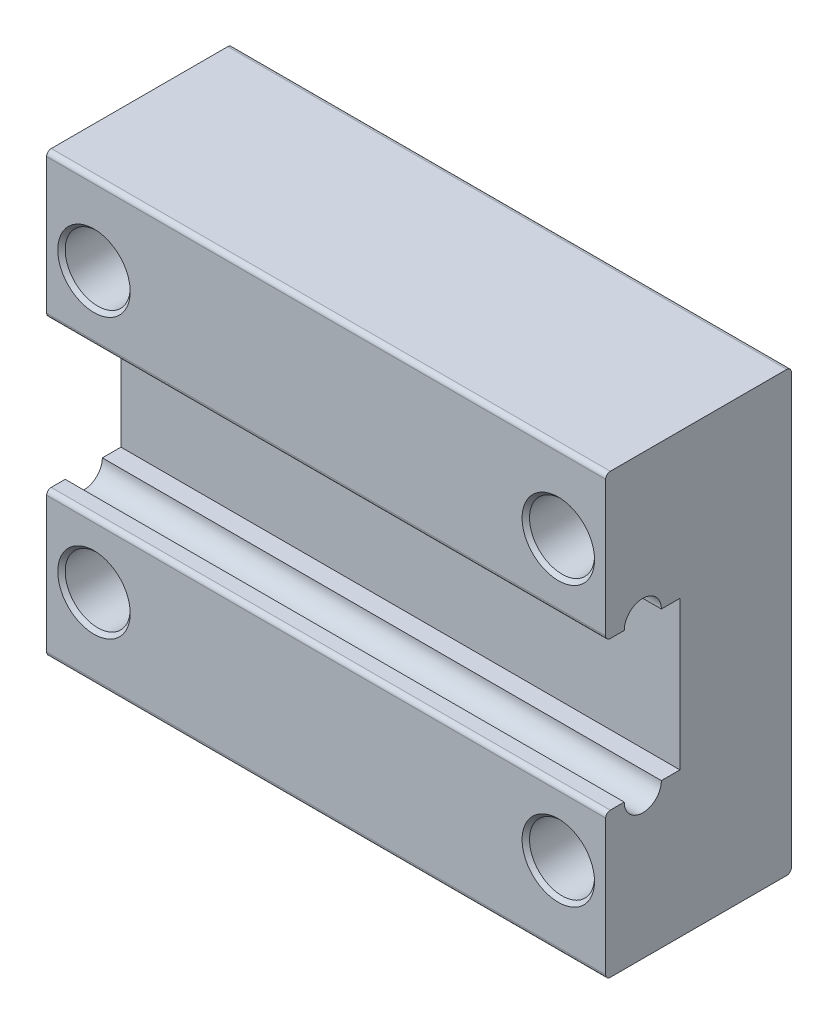
ISO-10303-21;
HEADER;
FILE_DESCRIPTION(('STEP AP214'),'2;1');
FILE_NAME('part.step','',(''),(''),'','','');
FILE_SCHEMA(('AUTOMOTIVE_DESIGN { 1 0 10303 214 1 1 1 1 }'));
ENDSEC;
DATA;
#1=APPLICATION_CONTEXT('core data for automotive mechanical design processes');
#2=APPLICATION_PROTOCOL_DEFINITION('international standard','automotive_design',2000,#1);
#3=PRODUCT_CONTEXT('',#1,'mechanical');
#4=PRODUCT('Part','Part','',(#3));
#5=PRODUCT_RELATED_PRODUCT_CATEGORY('part','',(#4));
#6=PRODUCT_DEFINITION_FORMATION('','',#4);
#7=PRODUCT_DEFINITION_CONTEXT('part definition',#1,'design');
#8=PRODUCT_DEFINITION('design','',#6,#7);
#9=PRODUCT_DEFINITION_SHAPE('','',#8);
#10=(LENGTH_UNIT() NAMED_UNIT(*) SI_UNIT(.MILLI.,.METRE.));
#11=(NAMED_UNIT(*) PLANE_ANGLE_UNIT() SI_UNIT($,.RADIAN.));
#12=(NAMED_UNIT(*) SI_UNIT($,.STERADIAN.) SOLID_ANGLE_UNIT());
#13=UNCERTAINTY_MEASURE_WITH_UNIT(LENGTH_MEASURE(1.E-05),#10,'distance_accuracy_value','');
#14=(GEOMETRIC_REPRESENTATION_CONTEXT(3) GLOBAL_UNCERTAINTY_ASSIGNED_CONTEXT((#13)) GLOBAL_UNIT_ASSIGNED_CONTEXT((#10,
#11,#12)) REPRESENTATION_CONTEXT('',''));
#15=CARTESIAN_POINT('',(0.,0.,0.));
#16=DIRECTION('',(0.,0.,1.));
#17=DIRECTION('',(1.,0.,0.));
#18=AXIS2_PLACEMENT_3D('',#15,#16,#17);
#19=CARTESIAN_POINT('',(0.,0.,10.));
#20=DIRECTION('',(0.,0.,1.));
#21=DIRECTION('',(1.,0.,0.));
#22=AXIS2_PLACEMENT_3D('',#19,#20,#21);
#23=PLANE('',#22);
#24=DIRECTION('',(0.,-1.,0.));
#25=VECTOR('',#24,1.);
#26=CARTESIAN_POINT('',(-15.05,17.4912238040008,10.));
#27=LINE('',#26,#25);
#28=CARTESIAN_POINT('',(-15.05,-4.25,10.));
#29=VERTEX_POINT('',#28);
#30=CARTESIAN_POINT('',(-15.05,-11.55,10.));
#31=VERTEX_POINT('',#30);
#32=EDGE_CURVE('E253',#29,#31,#27,.T.);
#33=ORIENTED_EDGE('',*,*,#32,.T.);
#34=DIRECTION('',(1.,0.,0.));
#35=VECTOR('',#34,1.);
#36=CARTESIAN_POINT('',(22.5,-11.55,10.));
#37=LINE('',#36,#35);
#38=CARTESIAN_POINT('',(15.05,-11.55,10.));
#39=VERTEX_POINT('',#38);
#40=EDGE_CURVE('E259',#31,#39,#37,.T.);
#41=ORIENTED_EDGE('',*,*,#40,.T.);
#42=DIRECTION('',(0.,1.,0.));
#43=VECTOR('',#42,1.);
#44=CARTESIAN_POINT('',(15.05,17.4912238040008,10.));
#45=LINE('',#44,#43);
#46=CARTESIAN_POINT('',(15.05,-4.25,10.));
#47=VERTEX_POINT('',#46);
#48=EDGE_CURVE('E254',#39,#47,#45,.T.);
#49=ORIENTED_EDGE('',*,*,#48,.T.);
#50=DIRECTION('',(1.,0.,0.));
#51=VECTOR('',#50,1.);
#52=CARTESIAN_POINT('',(0.,-4.25,10.));
#53=LINE('',#52,#51);
#54=EDGE_CURVE('E264',#47,#29,#53,.F.);
#55=ORIENTED_EDGE('',*,*,#54,.T.);
#56=EDGE_LOOP('',(#33,#41,#49,#55));
#57=FACE_BOUND('',#56,.T.);
#58=CARTESIAN_POINT('',(12.5,-7.5,10.));
#59=DIRECTION('',(0.,0.,1.));
#60=DIRECTION('',(1.,0.,0.));
#61=AXIS2_PLACEMENT_3D('',#58,#59,#60);
#62=CIRCLE('',#61,1.94999999999999);
#63=CARTESIAN_POINT('',(14.45,-7.5,10.));
#64=VERTEX_POINT('',#63);
#65=EDGE_CURVE('E305',#64,#64,#62,.F.);
#66=ORIENTED_EDGE('',*,*,#65,.T.);
#67=EDGE_LOOP('',(#66));
#68=FACE_BOUND('',#67,.T.);
#69=CARTESIAN_POINT('',(-12.4999999999999,-7.5,10.));
#70=DIRECTION('',(0.,0.,1.));
#71=DIRECTION('',(1.,0.,0.));
#72=AXIS2_PLACEMENT_3D('',#69,#70,#71);
#73=CIRCLE('',#72,1.94999999999999);
#74=CARTESIAN_POINT('',(-10.55,-7.5,10.));
#75=VERTEX_POINT('',#74);
#76=EDGE_CURVE('E302',#75,#75,#73,.F.);
#77=ORIENTED_EDGE('',*,*,#76,.T.);
#78=EDGE_LOOP('',(#77));
#79=FACE_BOUND('',#78,.T.);
#80=ADVANCED_FACE('F113',(#57,#68,#79),#23,.T.);
#81=CARTESIAN_POINT('',(-15.05,11.55,10.));
#82=VERTEX_POINT('',#81);
#83=CARTESIAN_POINT('',(-15.05,4.25,10.));
#84=VERTEX_POINT('',#83);
#85=EDGE_CURVE('E457',#82,#84,#27,.T.);
#86=ORIENTED_EDGE('',*,*,#85,.T.);
#87=DIRECTION('',(1.,0.,0.));
#88=VECTOR('',#87,1.);
#89=CARTESIAN_POINT('',(22.5,4.25,10.));
#90=LINE('',#89,#88);
#91=CARTESIAN_POINT('',(15.05,4.25,10.));
#92=VERTEX_POINT('',#91);
#93=EDGE_CURVE('E272',#84,#92,#90,.T.);
#94=ORIENTED_EDGE('',*,*,#93,.T.);
#95=CARTESIAN_POINT('',(15.05,11.55,10.));
#96=VERTEX_POINT('',#95);
#97=EDGE_CURVE('E336',#92,#96,#45,.T.);
#98=ORIENTED_EDGE('',*,*,#97,.T.);
#99=DIRECTION('',(-1.,0.,0.));
#100=VECTOR('',#99,1.);
#101=CARTESIAN_POINT('',(-22.5,11.55,10.));
#102=LINE('',#101,#100);
#103=EDGE_CURVE('E275',#96,#82,#102,.T.);
#104=ORIENTED_EDGE('',*,*,#103,.T.);
#105=EDGE_LOOP('',(#86,#94,#98,#104));
#106=FACE_BOUND('',#105,.T.);
#107=CARTESIAN_POINT('',(12.5,7.5,10.));
#108=DIRECTION('',(0.,0.,1.));
#109=DIRECTION('',(1.,0.,0.));
#110=AXIS2_PLACEMENT_3D('',#107,#108,#109);
#111=CIRCLE('',#110,1.95);
#112=CARTESIAN_POINT('',(14.45,7.5,10.));
#113=VERTEX_POINT('',#112);
#114=EDGE_CURVE('E323',#113,#113,#111,.F.);
#115=ORIENTED_EDGE('',*,*,#114,.T.);
#116=EDGE_LOOP('',(#115));
#117=FACE_BOUND('',#116,.T.);
#118=CARTESIAN_POINT('',(-12.5,7.5,10.));
#119=DIRECTION('',(0.,0.,1.));
#120=DIRECTION('',(1.,0.,0.));
#121=AXIS2_PLACEMENT_3D('',#118,#119,#120);
#122=CIRCLE('',#121,1.95);
#123=CARTESIAN_POINT('',(-10.55,7.5,10.));
#124=VERTEX_POINT('',#123);
#125=EDGE_CURVE('E320',#124,#124,#122,.F.);
#126=ORIENTED_EDGE('',*,*,#125,.T.);
#127=EDGE_LOOP('',(#126));
#128=FACE_BOUND('',#127,.T.);
#129=ADVANCED_FACE('F460',(#106,#117,#128),#23,.T.);
#130=CARTESIAN_POINT('',(0.,0.,0.));
#131=DIRECTION('',(0.,0.,1.));
#132=DIRECTION('',(1.,0.,0.));
#133=AXIS2_PLACEMENT_3D('',#130,#131,#132);
#134=PLANE('',#133);
#135=CARTESIAN_POINT('',(12.5,-7.5,0.));
#136=DIRECTION('',(0.,0.,1.));
#137=DIRECTION('',(1.,0.,0.));
#138=AXIS2_PLACEMENT_3D('',#135,#136,#137);
#139=CIRCLE('',#138,1.95000000000001);
#140=CARTESIAN_POINT('',(14.45,-7.5,0.));
#141=VERTEX_POINT('',#140);
#142=EDGE_CURVE('E293',#141,#141,#139,.T.);
#143=ORIENTED_EDGE('',*,*,#142,.T.);
#144=EDGE_LOOP('',(#143));
#145=FACE_BOUND('',#144,.T.);
#146=CARTESIAN_POINT('',(-12.4999999999999,-7.5,0.));
#147=DIRECTION('',(0.,0.,1.));
#148=DIRECTION('',(1.,0.,0.));
#149=AXIS2_PLACEMENT_3D('',#146,#147,#148);
#150=CIRCLE('',#149,1.95000000000001);
#151=CARTESIAN_POINT('',(-10.5499999999999,-7.5,0.));
#152=VERTEX_POINT('',#151);
#153=EDGE_CURVE('E290',#152,#152,#150,.T.);
#154=ORIENTED_EDGE('',*,*,#153,.T.);
#155=EDGE_LOOP('',(#154));
#156=FACE_BOUND('',#155,.T.);
#157=CARTESIAN_POINT('',(12.5,7.5,0.));
#158=DIRECTION('',(0.,0.,1.));
#159=DIRECTION('',(1.,0.,0.));
#160=AXIS2_PLACEMENT_3D('',#157,#158,#159);
#161=CIRCLE('',#160,1.95);
#162=CARTESIAN_POINT('',(14.45,7.5,0.));
#163=VERTEX_POINT('',#162);
#164=EDGE_CURVE('E287',#163,#163,#161,.T.);
#165=ORIENTED_EDGE('',*,*,#164,.T.);
#166=EDGE_LOOP('',(#165));
#167=FACE_BOUND('',#166,.T.);
#168=CARTESIAN_POINT('',(-12.5,7.5,0.));
#169=DIRECTION('',(0.,0.,1.));
#170=DIRECTION('',(1.,0.,0.));
#171=AXIS2_PLACEMENT_3D('',#168,#169,#170);
#172=CIRCLE('',#171,1.95);
#173=CARTESIAN_POINT('',(-10.55,7.5,0.));
#174=VERTEX_POINT('',#173);
#175=EDGE_CURVE('E284',#174,#174,#172,.T.);
#176=ORIENTED_EDGE('',*,*,#175,.T.);
#177=EDGE_LOOP('',(#176));
#178=FACE_BOUND('',#177,.T.);
#179=DIRECTION('',(1.,0.,0.));
#180=VECTOR('',#179,1.);
#181=CARTESIAN_POINT('',(0.,-11.55,0.));
#182=LINE('',#181,#180);
#183=CARTESIAN_POINT('',(15.05,-11.55,0.));
#184=VERTEX_POINT('',#183);
#185=CARTESIAN_POINT('',(-15.05,-11.55,0.));
#186=VERTEX_POINT('',#185);
#187=EDGE_CURVE('E252',#184,#186,#182,.F.);
#188=ORIENTED_EDGE('',*,*,#187,.T.);
#189=DIRECTION('',(0.,-1.,0.));
#190=VECTOR('',#189,1.);
#191=CARTESIAN_POINT('',(-15.05,17.4912238040008,0.));
#192=LINE('',#191,#190);
#193=CARTESIAN_POINT('',(-15.05,11.55,0.));
#194=VERTEX_POINT('',#193);
#195=EDGE_CURVE('E127',#194,#186,#192,.T.);
#196=ORIENTED_EDGE('',*,*,#195,.F.);
#197=DIRECTION('',(-1.,0.,0.));
#198=VECTOR('',#197,1.);
#199=CARTESIAN_POINT('',(0.,11.55,0.));
#200=LINE('',#199,#198);
#201=CARTESIAN_POINT('',(15.05,11.55,0.));
#202=VERTEX_POINT('',#201);
#203=EDGE_CURVE('E250',#194,#202,#200,.F.);
#204=ORIENTED_EDGE('',*,*,#203,.T.);
#205=DIRECTION('',(0.,1.,0.));
#206=VECTOR('',#205,1.);
#207=CARTESIAN_POINT('',(15.05,17.4912238040008,0.));
#208=LINE('',#207,#206);
#209=EDGE_CURVE('E332',#184,#202,#208,.T.);
#210=ORIENTED_EDGE('',*,*,#209,.F.);
#211=EDGE_LOOP('',(#188,#196,#204,#210));
#212=FACE_BOUND('',#211,.T.);
#213=ADVANCED_FACE('F248',(#145,#156,#167,#178,#212),#134,.F.);
#214=CARTESIAN_POINT('',(22.5,-11.8,10.));
#215=DIRECTION('',(0.,1.,0.));
#216=DIRECTION('',(-1.,0.,0.));
#217=AXIS2_PLACEMENT_3D('',#214,#215,#216);
#218=PLANE('',#217);
#219=DIRECTION('',(1.,0.,0.));
#220=VECTOR('',#219,1.);
#221=CARTESIAN_POINT('',(-22.5,-11.8,9.75));
#222=LINE('',#221,#220);
#223=CARTESIAN_POINT('',(15.05,-11.8,9.75));
#224=VERTEX_POINT('',#223);
#225=CARTESIAN_POINT('',(-15.05,-11.8,9.75));
#226=VERTEX_POINT('',#225);
#227=EDGE_CURVE('E347',#224,#226,#222,.F.);
#228=ORIENTED_EDGE('',*,*,#227,.T.);
#229=DIRECTION('',(0.,0.,-1.));
#230=VECTOR('',#229,1.);
#231=CARTESIAN_POINT('',(-15.05,-11.8,10.));
#232=LINE('',#231,#230);
#233=CARTESIAN_POINT('',(-15.05,-11.8,0.25));
#234=VERTEX_POINT('',#233);
#235=EDGE_CURVE('E341',#226,#234,#232,.T.);
#236=ORIENTED_EDGE('',*,*,#235,.T.);
#237=DIRECTION('',(1.,0.,0.));
#238=VECTOR('',#237,1.);
#239=CARTESIAN_POINT('',(22.5,-11.8,0.25));
#240=LINE('',#239,#238);
#241=CARTESIAN_POINT('',(15.05,-11.8,0.25));
#242=VERTEX_POINT('',#241);
#243=EDGE_CURVE('E339',#234,#242,#240,.T.);
#244=ORIENTED_EDGE('',*,*,#243,.T.);
#245=DIRECTION('',(0.,0.,1.));
#246=VECTOR('',#245,1.);
#247=CARTESIAN_POINT('',(15.05,-11.8,10.));
#248=LINE('',#247,#246);
#249=EDGE_CURVE('E135',#242,#224,#248,.T.);
#250=ORIENTED_EDGE('',*,*,#249,.T.);
#251=EDGE_LOOP('',(#228,#236,#244,#250));
#252=FACE_BOUND('',#251,.T.);
#253=ADVANCED_FACE('F345',(#252),#218,.F.);
#254=CARTESIAN_POINT('',(22.5,11.8,10.));
#255=DIRECTION('',(0.,-1.,0.));
#256=DIRECTION('',(1.,0.,0.));
#257=AXIS2_PLACEMENT_3D('',#254,#255,#256);
#258=PLANE('',#257);
#259=DIRECTION('',(-1.,0.,0.));
#260=VECTOR('',#259,1.);
#261=CARTESIAN_POINT('',(22.5,11.8,0.25));
#262=LINE('',#261,#260);
#263=CARTESIAN_POINT('',(15.05,11.8,0.25));
#264=VERTEX_POINT('',#263);
#265=CARTESIAN_POINT('',(-15.05,11.8,0.25));
#266=VERTEX_POINT('',#265);
#267=EDGE_CURVE('E261',#264,#266,#262,.T.);
#268=ORIENTED_EDGE('',*,*,#267,.T.);
#269=DIRECTION('',(0.,0.,1.));
#270=VECTOR('',#269,1.);
#271=CARTESIAN_POINT('',(-15.05,11.8,10.));
#272=LINE('',#271,#270);
#273=CARTESIAN_POINT('',(-15.05,11.8,9.75));
#274=VERTEX_POINT('',#273);
#275=EDGE_CURVE('E238',#266,#274,#272,.T.);
#276=ORIENTED_EDGE('',*,*,#275,.T.);
#277=DIRECTION('',(-1.,0.,0.));
#278=VECTOR('',#277,1.);
#279=CARTESIAN_POINT('',(22.5,11.8,9.75));
#280=LINE('',#279,#278);
#281=CARTESIAN_POINT('',(15.05,11.8,9.75));
#282=VERTEX_POINT('',#281);
#283=EDGE_CURVE('E269',#274,#282,#280,.F.);
#284=ORIENTED_EDGE('',*,*,#283,.T.);
#285=DIRECTION('',(0.,0.,-1.));
#286=VECTOR('',#285,1.);
#287=CARTESIAN_POINT('',(15.05,11.8,10.));
#288=LINE('',#287,#286);
#289=EDGE_CURVE('E353',#282,#264,#288,.T.);
#290=ORIENTED_EDGE('',*,*,#289,.T.);
#291=EDGE_LOOP('',(#268,#276,#284,#290));
#292=FACE_BOUND('',#291,.T.);
#293=ADVANCED_FACE('F481',(#292),#258,.F.);
#294=CARTESIAN_POINT('',(-12.5,7.5,10.));
#295=DIRECTION('',(0.,0.,-1.));
#296=DIRECTION('',(-1.,0.,0.));
#297=AXIS2_PLACEMENT_3D('',#294,#295,#296);
#298=CYLINDRICAL_SURFACE('',#297,1.75);
#299=CARTESIAN_POINT('',(-12.5,7.5,0.200000000000006));
#300=DIRECTION('',(0.,0.,1.));
#301=DIRECTION('',(1.,0.,0.));
#302=AXIS2_PLACEMENT_3D('',#299,#300,#301);
#303=CIRCLE('',#302,1.75);
#304=CARTESIAN_POINT('',(-10.75,7.5,0.200000000000006));
#305=VERTEX_POINT('',#304);
#306=EDGE_CURVE('E329',#305,#305,#303,.F.);
#307=ORIENTED_EDGE('',*,*,#306,.T.);
#308=EDGE_LOOP('',(#307));
#309=FACE_BOUND('',#308,.T.);
#310=CARTESIAN_POINT('',(-12.5,7.5,9.8));
#311=DIRECTION('',(0.,0.,1.));
#312=DIRECTION('',(1.,0.,0.));
#313=AXIS2_PLACEMENT_3D('',#310,#311,#312);
#314=CIRCLE('',#313,1.75);
#315=CARTESIAN_POINT('',(-10.75,7.5,9.8));
#316=VERTEX_POINT('',#315);
#317=EDGE_CURVE('E326',#316,#316,#314,.T.);
#318=ORIENTED_EDGE('',*,*,#317,.T.);
#319=EDGE_LOOP('',(#318));
#320=FACE_BOUND('',#319,.T.);
#321=ADVANCED_FACE('F501',(#309,#320),#298,.F.);
#322=CARTESIAN_POINT('',(12.5,7.5,10.));
#323=DIRECTION('',(0.,0.,-1.));
#324=DIRECTION('',(-1.,0.,0.));
#325=AXIS2_PLACEMENT_3D('',#322,#323,#324);
#326=CYLINDRICAL_SURFACE('',#325,1.75);
#327=CARTESIAN_POINT('',(12.5,7.5,0.200000000000006));
#328=DIRECTION('',(0.,0.,1.));
#329=DIRECTION('',(1.,0.,0.));
#330=AXIS2_PLACEMENT_3D('',#327,#328,#329);
#331=CIRCLE('',#330,1.75);
#332=CARTESIAN_POINT('',(14.25,7.5,0.200000000000006));
#333=VERTEX_POINT('',#332);
#334=EDGE_CURVE('E317',#333,#333,#331,.F.);
#335=ORIENTED_EDGE('',*,*,#334,.T.);
#336=EDGE_LOOP('',(#335));
#337=FACE_BOUND('',#336,.T.);
#338=CARTESIAN_POINT('',(12.5,7.5,9.8));
#339=DIRECTION('',(0.,0.,1.));
#340=DIRECTION('',(1.,0.,0.));
#341=AXIS2_PLACEMENT_3D('',#338,#339,#340);
#342=CIRCLE('',#341,1.75);
#343=CARTESIAN_POINT('',(14.25,7.5,9.8));
#344=VERTEX_POINT('',#343);
#345=EDGE_CURVE('E314',#344,#344,#342,.T.);
#346=ORIENTED_EDGE('',*,*,#345,.T.);
#347=EDGE_LOOP('',(#346));
#348=FACE_BOUND('',#347,.T.);
#349=ADVANCED_FACE('F568',(#337,#348),#326,.F.);
#350=CARTESIAN_POINT('',(12.5,-7.5,10.));
#351=DIRECTION('',(0.,0.,-1.));
#352=DIRECTION('',(-1.,0.,0.));
#353=AXIS2_PLACEMENT_3D('',#350,#351,#352);
#354=CYLINDRICAL_SURFACE('',#353,1.75);
#355=CARTESIAN_POINT('',(12.5,-7.5,0.200000000000006));
#356=DIRECTION('',(0.,0.,1.));
#357=DIRECTION('',(1.,0.,0.));
#358=AXIS2_PLACEMENT_3D('',#355,#356,#357);
#359=CIRCLE('',#358,1.75);
#360=CARTESIAN_POINT('',(14.25,-7.5,0.200000000000006));
#361=VERTEX_POINT('',#360);
#362=EDGE_CURVE('E299',#361,#361,#359,.F.);
#363=ORIENTED_EDGE('',*,*,#362,.T.);
#364=EDGE_LOOP('',(#363));
#365=FACE_BOUND('',#364,.T.);
#366=CARTESIAN_POINT('',(12.5,-7.5,9.8));
#367=DIRECTION('',(0.,0.,1.));
#368=DIRECTION('',(1.,0.,0.));
#369=AXIS2_PLACEMENT_3D('',#366,#367,#368);
#370=CIRCLE('',#369,1.75);
#371=CARTESIAN_POINT('',(14.25,-7.5,9.8));
#372=VERTEX_POINT('',#371);
#373=EDGE_CURVE('E296',#372,#372,#370,.T.);
#374=ORIENTED_EDGE('',*,*,#373,.T.);
#375=EDGE_LOOP('',(#374));
#376=FACE_BOUND('',#375,.T.);
#377=ADVANCED_FACE('F565',(#365,#376),#354,.F.);
#378=CARTESIAN_POINT('',(-12.4999999999999,-7.5,10.));
#379=DIRECTION('',(0.,0.,-1.));
#380=DIRECTION('',(-1.,0.,0.));
#381=AXIS2_PLACEMENT_3D('',#378,#379,#380);
#382=CYLINDRICAL_SURFACE('',#381,1.75);
#383=CARTESIAN_POINT('',(-12.4999999999999,-7.5,0.200000000000006));
#384=DIRECTION('',(0.,0.,1.));
#385=DIRECTION('',(1.,0.,0.));
#386=AXIS2_PLACEMENT_3D('',#383,#384,#385);
#387=CIRCLE('',#386,1.75);
#388=CARTESIAN_POINT('',(-10.7499999999999,-7.5,0.200000000000006));
#389=VERTEX_POINT('',#388);
#390=EDGE_CURVE('E311',#389,#389,#387,.F.);
#391=ORIENTED_EDGE('',*,*,#390,.T.);
#392=EDGE_LOOP('',(#391));
#393=FACE_BOUND('',#392,.T.);
#394=CARTESIAN_POINT('',(-12.4999999999999,-7.5,9.8));
#395=DIRECTION('',(0.,0.,1.));
#396=DIRECTION('',(1.,0.,0.));
#397=AXIS2_PLACEMENT_3D('',#394,#395,#396);
#398=CIRCLE('',#397,1.75);
#399=CARTESIAN_POINT('',(-10.7499999999999,-7.5,9.8));
#400=VERTEX_POINT('',#399);
#401=EDGE_CURVE('E308',#400,#400,#398,.T.);
#402=ORIENTED_EDGE('',*,*,#401,.T.);
#403=EDGE_LOOP('',(#402));
#404=FACE_BOUND('',#403,.T.);
#405=ADVANCED_FACE('F554',(#393,#404),#382,.F.);
#406=CARTESIAN_POINT('',(-22.5,4.,0.));
#407=DIRECTION('',(0.,1.,0.));
#408=DIRECTION('',(0.,0.,1.));
#409=AXIS2_PLACEMENT_3D('',#406,#407,#408);
#410=PLANE('',#409);
#411=DIRECTION('',(1.,0.,0.));
#412=VECTOR('',#411,1.);
#413=CARTESIAN_POINT('',(-22.5,4.,9.75));
#414=LINE('',#413,#412);
#415=CARTESIAN_POINT('',(15.05,4.,9.75));
#416=VERTEX_POINT('',#415);
#417=CARTESIAN_POINT('',(-15.05,4.,9.75));
#418=VERTEX_POINT('',#417);
#419=EDGE_CURVE('E278',#416,#418,#414,.F.);
#420=ORIENTED_EDGE('',*,*,#419,.T.);
#421=DIRECTION('',(0.,0.,-1.));
#422=VECTOR('',#421,1.);
#423=CARTESIAN_POINT('',(-15.05,4.,0.));
#424=LINE('',#423,#422);
#425=CARTESIAN_POINT('',(-15.05,4.,9.));
#426=VERTEX_POINT('',#425);
#427=EDGE_CURVE('E373',#418,#426,#424,.T.);
#428=ORIENTED_EDGE('',*,*,#427,.T.);
#429=DIRECTION('',(1.,0.,0.));
#430=VECTOR('',#429,1.);
#431=CARTESIAN_POINT('',(-22.5,4.,9.));
#432=LINE('',#431,#430);
#433=CARTESIAN_POINT('',(15.05,4.,9.));
#434=VERTEX_POINT('',#433);
#435=EDGE_CURVE('E381',#426,#434,#432,.T.);
#436=ORIENTED_EDGE('',*,*,#435,.T.);
#437=DIRECTION('',(0.,0.,1.));
#438=VECTOR('',#437,1.);
#439=CARTESIAN_POINT('',(15.05,4.,0.));
#440=LINE('',#439,#438);
#441=EDGE_CURVE('E450',#434,#416,#440,.T.);
#442=ORIENTED_EDGE('',*,*,#441,.T.);
#443=EDGE_LOOP('',(#420,#428,#436,#442));
#444=FACE_BOUND('',#443,.T.);
#445=ADVANCED_FACE('F447',(#444),#410,.F.);
#446=DIRECTION('',(1.,0.,0.));
#447=VECTOR('',#446,1.);
#448=CARTESIAN_POINT('',(-22.5,4.,7.));
#449=LINE('',#448,#447);
#450=CARTESIAN_POINT('',(-15.05,4.,7.));
#451=VERTEX_POINT('',#450);
#452=CARTESIAN_POINT('',(15.05,4.,7.));
#453=VERTEX_POINT('',#452);
#454=EDGE_CURVE('E384',#451,#453,#449,.T.);
#455=ORIENTED_EDGE('',*,*,#454,.F.);
#456=DIRECTION('',(0.,0.,-1.));
#457=VECTOR('',#456,1.);
#458=CARTESIAN_POINT('',(-15.05,4.,0.));
#459=LINE('',#458,#457);
#460=CARTESIAN_POINT('',(-15.05,4.,6.00000000000001));
#461=VERTEX_POINT('',#460);
#462=EDGE_CURVE('E367',#451,#461,#459,.T.);
#463=ORIENTED_EDGE('',*,*,#462,.T.);
#464=DIRECTION('',(1.,0.,0.));
#465=VECTOR('',#464,1.);
#466=CARTESIAN_POINT('',(-22.5,4.,6.00000000000001));
#467=LINE('',#466,#465);
#468=CARTESIAN_POINT('',(15.05,4.,6.00000000000001));
#469=VERTEX_POINT('',#468);
#470=EDGE_CURVE('E387',#461,#469,#467,.T.);
#471=ORIENTED_EDGE('',*,*,#470,.T.);
#472=DIRECTION('',(0.,0.,1.));
#473=VECTOR('',#472,1.);
#474=CARTESIAN_POINT('',(15.05,4.,0.));
#475=LINE('',#474,#473);
#476=EDGE_CURVE('E439',#469,#453,#475,.T.);
#477=ORIENTED_EDGE('',*,*,#476,.T.);
#478=EDGE_LOOP('',(#455,#463,#471,#477));
#479=FACE_BOUND('',#478,.T.);
#480=ADVANCED_FACE('F437',(#479),#410,.F.);
#481=CARTESIAN_POINT('',(-22.5,0.,6.));
#482=DIRECTION('',(0.,0.,-1.));
#483=DIRECTION('',(0.,1.,0.));
#484=AXIS2_PLACEMENT_3D('',#481,#482,#483);
#485=PLANE('',#484);
#486=ORIENTED_EDGE('',*,*,#470,.F.);
#487=DIRECTION('',(0.,-1.,0.));
#488=VECTOR('',#487,1.);
#489=CARTESIAN_POINT('',(-15.05,0.,6.));
#490=LINE('',#489,#488);
#491=CARTESIAN_POINT('',(-15.05,-4.,6.));
#492=VERTEX_POINT('',#491);
#493=EDGE_CURVE('E364',#461,#492,#490,.T.);
#494=ORIENTED_EDGE('',*,*,#493,.T.);
#495=DIRECTION('',(1.,0.,0.));
#496=VECTOR('',#495,1.);
#497=CARTESIAN_POINT('',(-22.5,-4.,6.));
#498=LINE('',#497,#496);
#499=CARTESIAN_POINT('',(15.05,-4.,6.));
#500=VERTEX_POINT('',#499);
#501=EDGE_CURVE('E390',#492,#500,#498,.T.);
#502=ORIENTED_EDGE('',*,*,#501,.T.);
#503=DIRECTION('',(0.,1.,0.));
#504=VECTOR('',#503,1.);
#505=CARTESIAN_POINT('',(15.05,0.,6.));
#506=LINE('',#505,#504);
#507=EDGE_CURVE('E434',#500,#469,#506,.T.);
#508=ORIENTED_EDGE('',*,*,#507,.T.);
#509=EDGE_LOOP('',(#486,#494,#502,#508));
#510=FACE_BOUND('',#509,.T.);
#511=ADVANCED_FACE('F433',(#510),#485,.F.);
#512=CARTESIAN_POINT('',(-22.5,-4.,0.));
#513=DIRECTION('',(0.,1.,0.));
#514=DIRECTION('',(0.,0.,1.));
#515=AXIS2_PLACEMENT_3D('',#512,#513,#514);
#516=PLANE('',#515);
#517=DIRECTION('',(0.,0.,-1.));
#518=VECTOR('',#517,1.);
#519=CARTESIAN_POINT('',(-15.05,-4.,0.));
#520=LINE('',#519,#518);
#521=CARTESIAN_POINT('',(-15.05,-4.,7.));
#522=VERTEX_POINT('',#521);
#523=EDGE_CURVE('E362',#522,#492,#520,.T.);
#524=ORIENTED_EDGE('',*,*,#523,.F.);
#525=DIRECTION('',(1.,0.,0.));
#526=VECTOR('',#525,1.);
#527=CARTESIAN_POINT('',(-22.5,-4.,7.));
#528=LINE('',#527,#526);
#529=CARTESIAN_POINT('',(15.05,-4.,7.));
#530=VERTEX_POINT('',#529);
#531=EDGE_CURVE('E393',#522,#530,#528,.T.);
#532=ORIENTED_EDGE('',*,*,#531,.T.);
#533=DIRECTION('',(0.,0.,1.));
#534=VECTOR('',#533,1.);
#535=CARTESIAN_POINT('',(15.05,-4.,0.));
#536=LINE('',#535,#534);
#537=EDGE_CURVE('E429',#500,#530,#536,.T.);
#538=ORIENTED_EDGE('',*,*,#537,.F.);
#539=ORIENTED_EDGE('',*,*,#501,.F.);
#540=EDGE_LOOP('',(#524,#532,#538,#539));
#541=FACE_BOUND('',#540,.T.);
#542=ADVANCED_FACE('F427',(#541),#516,.T.);
#543=DIRECTION('',(0.,0.,-1.));
#544=VECTOR('',#543,1.);
#545=CARTESIAN_POINT('',(-15.05,-4.,0.));
#546=LINE('',#545,#544);
#547=CARTESIAN_POINT('',(-15.05,-4.,9.75));
#548=VERTEX_POINT('',#547);
#549=CARTESIAN_POINT('',(-15.05,-4.,9.));
#550=VERTEX_POINT('',#549);
#551=EDGE_CURVE('E358',#548,#550,#546,.T.);
#552=ORIENTED_EDGE('',*,*,#551,.F.);
#553=DIRECTION('',(1.,0.,0.));
#554=VECTOR('',#553,1.);
#555=CARTESIAN_POINT('',(-22.5,-4.,9.75));
#556=LINE('',#555,#554);
#557=CARTESIAN_POINT('',(15.05,-4.,9.75));
#558=VERTEX_POINT('',#557);
#559=EDGE_CURVE('E281',#548,#558,#556,.T.);
#560=ORIENTED_EDGE('',*,*,#559,.T.);
#561=DIRECTION('',(0.,0.,1.));
#562=VECTOR('',#561,1.);
#563=CARTESIAN_POINT('',(15.05,-4.,0.));
#564=LINE('',#563,#562);
#565=CARTESIAN_POINT('',(15.05,-4.,9.));
#566=VERTEX_POINT('',#565);
#567=EDGE_CURVE('E418',#566,#558,#564,.T.);
#568=ORIENTED_EDGE('',*,*,#567,.F.);
#569=DIRECTION('',(1.,0.,0.));
#570=VECTOR('',#569,1.);
#571=CARTESIAN_POINT('',(-22.5,-4.,9.));
#572=LINE('',#571,#570);
#573=EDGE_CURVE('E380',#550,#566,#572,.T.);
#574=ORIENTED_EDGE('',*,*,#573,.F.);
#575=EDGE_LOOP('',(#552,#560,#568,#574));
#576=FACE_BOUND('',#575,.T.);
#577=ADVANCED_FACE('F416',(#576),#516,.T.);
#578=CARTESIAN_POINT('',(-22.5,4.,8.));
#579=DIRECTION('',(1.,0.,0.));
#580=DIRECTION('',(0.,0.,-1.));
#581=AXIS2_PLACEMENT_3D('',#578,#579,#580);
#582=CYLINDRICAL_SURFACE('',#581,1.);
#583=ORIENTED_EDGE('',*,*,#435,.F.);
#584=CARTESIAN_POINT('',(-15.05,4.,8.));
#585=DIRECTION('',(1.,0.,0.));
#586=DIRECTION('',(0.,1.,0.));
#587=AXIS2_PLACEMENT_3D('',#584,#585,#586);
#588=CIRCLE('',#587,1.);
#589=EDGE_CURVE('E370',#426,#451,#588,.F.);
#590=ORIENTED_EDGE('',*,*,#589,.T.);
#591=ORIENTED_EDGE('',*,*,#454,.T.);
#592=CARTESIAN_POINT('',(15.05,4.,8.));
#593=DIRECTION('',(-1.,0.,0.));
#594=DIRECTION('',(0.,-1.,0.));
#595=AXIS2_PLACEMENT_3D('',#592,#593,#594);
#596=CIRCLE('',#595,1.);
#597=EDGE_CURVE('E444',#453,#434,#596,.F.);
#598=ORIENTED_EDGE('',*,*,#597,.T.);
#599=EDGE_LOOP('',(#583,#590,#591,#598));
#600=FACE_BOUND('',#599,.T.);
#601=ADVANCED_FACE('F443',(#600),#582,.F.);
#602=CARTESIAN_POINT('',(-22.5,-4.,8.));
#603=DIRECTION('',(1.,0.,0.));
#604=DIRECTION('',(0.,0.,-1.));
#605=AXIS2_PLACEMENT_3D('',#602,#603,#604);
#606=CYLINDRICAL_SURFACE('',#605,1.);
#607=CARTESIAN_POINT('',(-15.05,-4.,8.));
#608=DIRECTION('',(1.,0.,0.));
#609=DIRECTION('',(0.,1.,0.));
#610=AXIS2_PLACEMENT_3D('',#607,#608,#609);
#611=CIRCLE('',#610,1.);
#612=EDGE_CURVE('E360',#550,#522,#611,.T.);
#613=ORIENTED_EDGE('',*,*,#612,.F.);
#614=ORIENTED_EDGE('',*,*,#573,.T.);
#615=CARTESIAN_POINT('',(15.05,-4.,8.));
#616=DIRECTION('',(-1.,0.,0.));
#617=DIRECTION('',(0.,-1.,0.));
#618=AXIS2_PLACEMENT_3D('',#615,#616,#617);
#619=CIRCLE('',#618,1.);
#620=EDGE_CURVE('E423',#530,#566,#619,.T.);
#621=ORIENTED_EDGE('',*,*,#620,.F.);
#622=ORIENTED_EDGE('',*,*,#531,.F.);
#623=EDGE_LOOP('',(#613,#614,#621,#622));
#624=FACE_BOUND('',#623,.T.);
#625=ADVANCED_FACE('F421',(#624),#606,.F.);
#626=CARTESIAN_POINT('',(0.,4.25,9.75));
#627=DIRECTION('',(-1.,0.,0.));
#628=DIRECTION('',(0.,0.,1.));
#629=AXIS2_PLACEMENT_3D('',#626,#627,#628);
#630=CYLINDRICAL_SURFACE('',#629,0.25);
#631=CARTESIAN_POINT('',(-15.05,4.25,9.75));
#632=DIRECTION('',(1.,0.,0.));
#633=DIRECTION('',(0.,1.,0.));
#634=AXIS2_PLACEMENT_3D('',#631,#632,#633);
#635=CIRCLE('',#634,0.25);
#636=EDGE_CURVE('E243',#418,#84,#635,.F.);
#637=ORIENTED_EDGE('',*,*,#636,.F.);
#638=ORIENTED_EDGE('',*,*,#419,.F.);
#639=CARTESIAN_POINT('',(15.05,4.25,9.75));
#640=DIRECTION('',(-1.,0.,0.));
#641=DIRECTION('',(0.,-1.,0.));
#642=AXIS2_PLACEMENT_3D('',#639,#640,#641);
#643=CIRCLE('',#642,0.25);
#644=EDGE_CURVE('E455',#92,#416,#643,.F.);
#645=ORIENTED_EDGE('',*,*,#644,.F.);
#646=ORIENTED_EDGE('',*,*,#93,.F.);
#647=EDGE_LOOP('',(#637,#638,#645,#646));
#648=FACE_BOUND('',#647,.T.);
#649=ADVANCED_FACE('F453',(#648),#630,.T.);
#650=CARTESIAN_POINT('',(0.,11.55,9.75));
#651=DIRECTION('',(1.,0.,0.));
#652=DIRECTION('',(0.,1.,0.));
#653=AXIS2_PLACEMENT_3D('',#650,#651,#652);
#654=CYLINDRICAL_SURFACE('',#653,0.25);
#655=CARTESIAN_POINT('',(-15.05,11.55,9.75));
#656=DIRECTION('',(1.,0.,0.));
#657=DIRECTION('',(0.,1.,0.));
#658=AXIS2_PLACEMENT_3D('',#655,#656,#657);
#659=CIRCLE('',#658,0.25);
#660=EDGE_CURVE('E378',#82,#274,#659,.F.);
#661=ORIENTED_EDGE('',*,*,#660,.F.);
#662=ORIENTED_EDGE('',*,*,#103,.F.);
#663=CARTESIAN_POINT('',(15.05,11.55,9.75));
#664=DIRECTION('',(-1.,0.,0.));
#665=DIRECTION('',(0.,-1.,0.));
#666=AXIS2_PLACEMENT_3D('',#663,#664,#665);
#667=CIRCLE('',#666,0.25);
#668=EDGE_CURVE('E349',#282,#96,#667,.F.);
#669=ORIENTED_EDGE('',*,*,#668,.F.);
#670=ORIENTED_EDGE('',*,*,#283,.F.);
#671=EDGE_LOOP('',(#661,#662,#669,#670));
#672=FACE_BOUND('',#671,.T.);
#673=ADVANCED_FACE('F485',(#672),#654,.T.);
#674=CARTESIAN_POINT('',(22.5,11.55,0.25));
#675=DIRECTION('',(-1.,0.,0.));
#676=DIRECTION('',(0.,-1.,0.));
#677=AXIS2_PLACEMENT_3D('',#674,#675,#676);
#678=CYLINDRICAL_SURFACE('',#677,0.25);
#679=CARTESIAN_POINT('',(-15.05,11.55,0.25));
#680=DIRECTION('',(1.,0.,0.));
#681=DIRECTION('',(0.,1.,0.));
#682=AXIS2_PLACEMENT_3D('',#679,#680,#681);
#683=CIRCLE('',#682,0.25);
#684=EDGE_CURVE('E235',#266,#194,#683,.F.);
#685=ORIENTED_EDGE('',*,*,#684,.F.);
#686=ORIENTED_EDGE('',*,*,#267,.F.);
#687=CARTESIAN_POINT('',(15.05,11.55,0.25));
#688=DIRECTION('',(-1.,0.,0.));
#689=DIRECTION('',(0.,-1.,0.));
#690=AXIS2_PLACEMENT_3D('',#687,#688,#689);
#691=CIRCLE('',#690,0.25);
#692=EDGE_CURVE('E258',#202,#264,#691,.F.);
#693=ORIENTED_EDGE('',*,*,#692,.F.);
#694=ORIENTED_EDGE('',*,*,#203,.F.);
#695=EDGE_LOOP('',(#685,#686,#693,#694));
#696=FACE_BOUND('',#695,.T.);
#697=ADVANCED_FACE('F257',(#696),#678,.T.);
#698=CARTESIAN_POINT('',(-22.5,-4.25,9.75));
#699=DIRECTION('',(1.,0.,0.));
#700=DIRECTION('',(0.,0.,-1.));
#701=AXIS2_PLACEMENT_3D('',#698,#699,#700);
#702=CYLINDRICAL_SURFACE('',#701,0.25);
#703=CARTESIAN_POINT('',(-15.05,-4.25,9.75));
#704=DIRECTION('',(1.,0.,0.));
#705=DIRECTION('',(0.,1.,0.));
#706=AXIS2_PLACEMENT_3D('',#703,#704,#705);
#707=CIRCLE('',#706,0.25);
#708=EDGE_CURVE('E351',#29,#548,#707,.F.);
#709=ORIENTED_EDGE('',*,*,#708,.F.);
#710=ORIENTED_EDGE('',*,*,#54,.F.);
#711=CARTESIAN_POINT('',(15.05,-4.25,9.75));
#712=DIRECTION('',(-1.,0.,0.));
#713=DIRECTION('',(0.,-1.,0.));
#714=AXIS2_PLACEMENT_3D('',#711,#712,#713);
#715=CIRCLE('',#714,0.25);
#716=EDGE_CURVE('E411',#558,#47,#715,.F.);
#717=ORIENTED_EDGE('',*,*,#716,.F.);
#718=ORIENTED_EDGE('',*,*,#559,.F.);
#719=EDGE_LOOP('',(#709,#710,#717,#718));
#720=FACE_BOUND('',#719,.T.);
#721=ADVANCED_FACE('F409',(#720),#702,.T.);
#722=CARTESIAN_POINT('',(0.,-11.55,9.75));
#723=DIRECTION('',(-1.,0.,0.));
#724=DIRECTION('',(0.,-1.,0.));
#725=AXIS2_PLACEMENT_3D('',#722,#723,#724);
#726=CYLINDRICAL_SURFACE('',#725,0.25);
#727=CARTESIAN_POINT('',(-15.05,-11.55,9.75));
#728=DIRECTION('',(1.,0.,0.));
#729=DIRECTION('',(0.,1.,0.));
#730=AXIS2_PLACEMENT_3D('',#727,#728,#729);
#731=CIRCLE('',#730,0.25);
#732=EDGE_CURVE('E348',#226,#31,#731,.F.);
#733=ORIENTED_EDGE('',*,*,#732,.F.);
#734=ORIENTED_EDGE('',*,*,#227,.F.);
#735=CARTESIAN_POINT('',(15.05,-11.55,9.75));
#736=DIRECTION('',(-1.,0.,0.));
#737=DIRECTION('',(0.,-1.,0.));
#738=AXIS2_PLACEMENT_3D('',#735,#736,#737);
#739=CIRCLE('',#738,0.25);
#740=EDGE_CURVE('E465',#39,#224,#739,.F.);
#741=ORIENTED_EDGE('',*,*,#740,.F.);
#742=ORIENTED_EDGE('',*,*,#40,.F.);
#743=EDGE_LOOP('',(#733,#734,#741,#742));
#744=FACE_BOUND('',#743,.T.);
#745=ADVANCED_FACE('F513',(#744),#726,.T.);
#746=CARTESIAN_POINT('',(22.5,-11.55,0.25));
#747=DIRECTION('',(1.,0.,0.));
#748=DIRECTION('',(0.,1.,0.));
#749=AXIS2_PLACEMENT_3D('',#746,#747,#748);
#750=CYLINDRICAL_SURFACE('',#749,0.25);
#751=CARTESIAN_POINT('',(-15.05,-11.55,0.25));
#752=DIRECTION('',(1.,0.,0.));
#753=DIRECTION('',(0.,1.,0.));
#754=AXIS2_PLACEMENT_3D('',#751,#752,#753);
#755=CIRCLE('',#754,0.25);
#756=EDGE_CURVE('E12',#186,#234,#755,.F.);
#757=ORIENTED_EDGE('',*,*,#756,.F.);
#758=ORIENTED_EDGE('',*,*,#187,.F.);
#759=CARTESIAN_POINT('',(15.05,-11.55,0.25));
#760=DIRECTION('',(-1.,0.,0.));
#761=DIRECTION('',(0.,-1.,0.));
#762=AXIS2_PLACEMENT_3D('',#759,#760,#761);
#763=CIRCLE('',#762,0.25);
#764=EDGE_CURVE('E121',#242,#184,#763,.F.);
#765=ORIENTED_EDGE('',*,*,#764,.F.);
#766=ORIENTED_EDGE('',*,*,#243,.F.);
#767=EDGE_LOOP('',(#757,#758,#765,#766));
#768=FACE_BOUND('',#767,.T.);
#769=ADVANCED_FACE('F338',(#768),#750,.T.);
#770=CARTESIAN_POINT('',(12.5,-7.5,0.));
#771=DIRECTION('',(0.,0.,-1.));
#772=DIRECTION('',(-1.,0.,0.));
#773=AXIS2_PLACEMENT_3D('',#770,#771,#772);
#774=CONICAL_SURFACE('',#773,1.95000000000001,0.785398163397453);
#775=ORIENTED_EDGE('',*,*,#362,.F.);
#776=EDGE_LOOP('',(#775));
#777=FACE_BOUND('',#776,.T.);
#778=ORIENTED_EDGE('',*,*,#142,.F.);
#779=EDGE_LOOP('',(#778));
#780=FACE_BOUND('',#779,.T.);
#781=ADVANCED_FACE('F512',(#777,#780),#774,.F.);
#782=CARTESIAN_POINT('',(12.5,-7.5,9.8));
#783=DIRECTION('',(0.,0.,1.));
#784=DIRECTION('',(1.,0.,0.));
#785=AXIS2_PLACEMENT_3D('',#782,#783,#784);
#786=CONICAL_SURFACE('',#785,1.75,0.785398163397444);
#787=ORIENTED_EDGE('',*,*,#65,.F.);
#788=EDGE_LOOP('',(#787));
#789=FACE_BOUND('',#788,.T.);
#790=ORIENTED_EDGE('',*,*,#373,.F.);
#791=EDGE_LOOP('',(#790));
#792=FACE_BOUND('',#791,.T.);
#793=ADVANCED_FACE('F602',(#789,#792),#786,.F.);
#794=CARTESIAN_POINT('',(-12.4999999999999,-7.5,0.));
#795=DIRECTION('',(0.,0.,-1.));
#796=DIRECTION('',(-1.,0.,0.));
#797=AXIS2_PLACEMENT_3D('',#794,#795,#796);
#798=CONICAL_SURFACE('',#797,1.95000000000001,0.785398163397453);
#799=ORIENTED_EDGE('',*,*,#390,.F.);
#800=EDGE_LOOP('',(#799));
#801=FACE_BOUND('',#800,.T.);
#802=ORIENTED_EDGE('',*,*,#153,.F.);
#803=EDGE_LOOP('',(#802));
#804=FACE_BOUND('',#803,.T.);
#805=ADVANCED_FACE('F598',(#801,#804),#798,.F.);
#806=CARTESIAN_POINT('',(-12.4999999999999,-7.5,9.8));
#807=DIRECTION('',(0.,0.,1.));
#808=DIRECTION('',(1.,0.,0.));
#809=AXIS2_PLACEMENT_3D('',#806,#807,#808);
#810=CONICAL_SURFACE('',#809,1.75,0.785398163397444);
#811=ORIENTED_EDGE('',*,*,#76,.F.);
#812=EDGE_LOOP('',(#811));
#813=FACE_BOUND('',#812,.T.);
#814=ORIENTED_EDGE('',*,*,#401,.F.);
#815=EDGE_LOOP('',(#814));
#816=FACE_BOUND('',#815,.T.);
#817=ADVANCED_FACE('F591',(#813,#816),#810,.F.);
#818=CARTESIAN_POINT('',(12.5,7.5,0.));
#819=DIRECTION('',(0.,0.,-1.));
#820=DIRECTION('',(-1.,0.,0.));
#821=AXIS2_PLACEMENT_3D('',#818,#819,#820);
#822=CONICAL_SURFACE('',#821,1.95,0.785398163397435);
#823=ORIENTED_EDGE('',*,*,#334,.F.);
#824=EDGE_LOOP('',(#823));
#825=FACE_BOUND('',#824,.T.);
#826=ORIENTED_EDGE('',*,*,#164,.F.);
#827=EDGE_LOOP('',(#826));
#828=FACE_BOUND('',#827,.T.);
#829=ADVANCED_FACE('F583',(#825,#828),#822,.F.);
#830=CARTESIAN_POINT('',(12.5,7.5,9.8));
#831=DIRECTION('',(0.,0.,1.));
#832=DIRECTION('',(1.,0.,0.));
#833=AXIS2_PLACEMENT_3D('',#830,#831,#832);
#834=CONICAL_SURFACE('',#833,1.75,0.785398163397448);
#835=ORIENTED_EDGE('',*,*,#114,.F.);
#836=EDGE_LOOP('',(#835));
#837=FACE_BOUND('',#836,.T.);
#838=ORIENTED_EDGE('',*,*,#345,.F.);
#839=EDGE_LOOP('',(#838));
#840=FACE_BOUND('',#839,.T.);
#841=ADVANCED_FACE('F580',(#837,#840),#834,.F.);
#842=CARTESIAN_POINT('',(-12.5,7.5,0.));
#843=DIRECTION('',(0.,0.,-1.));
#844=DIRECTION('',(-1.,0.,0.));
#845=AXIS2_PLACEMENT_3D('',#842,#843,#844);
#846=CONICAL_SURFACE('',#845,1.95,0.785398163397435);
#847=ORIENTED_EDGE('',*,*,#306,.F.);
#848=EDGE_LOOP('',(#847));
#849=FACE_BOUND('',#848,.T.);
#850=ORIENTED_EDGE('',*,*,#175,.F.);
#851=EDGE_LOOP('',(#850));
#852=FACE_BOUND('',#851,.T.);
#853=ADVANCED_FACE('F582',(#849,#852),#846,.F.);
#854=CARTESIAN_POINT('',(-12.5,7.5,9.8));
#855=DIRECTION('',(0.,0.,1.));
#856=DIRECTION('',(1.,0.,0.));
#857=AXIS2_PLACEMENT_3D('',#854,#855,#856);
#858=CONICAL_SURFACE('',#857,1.75,0.785398163397448);
#859=ORIENTED_EDGE('',*,*,#125,.F.);
#860=EDGE_LOOP('',(#859));
#861=FACE_BOUND('',#860,.T.);
#862=ORIENTED_EDGE('',*,*,#317,.F.);
#863=EDGE_LOOP('',(#862));
#864=FACE_BOUND('',#863,.T.);
#865=ADVANCED_FACE('F115',(#861,#864),#858,.F.);
#866=CARTESIAN_POINT('',(15.05,17.4912238040008,10.));
#867=DIRECTION('',(-1.,0.,0.));
#868=DIRECTION('',(0.,-1.,0.));
#869=AXIS2_PLACEMENT_3D('',#866,#867,#868);
#870=PLANE('',#869);
#871=ORIENTED_EDGE('',*,*,#668,.T.);
#872=ORIENTED_EDGE('',*,*,#97,.F.);
#873=ORIENTED_EDGE('',*,*,#644,.T.);
#874=ORIENTED_EDGE('',*,*,#441,.F.);
#875=ORIENTED_EDGE('',*,*,#597,.F.);
#876=ORIENTED_EDGE('',*,*,#476,.F.);
#877=ORIENTED_EDGE('',*,*,#507,.F.);
#878=ORIENTED_EDGE('',*,*,#537,.T.);
#879=ORIENTED_EDGE('',*,*,#620,.T.);
#880=ORIENTED_EDGE('',*,*,#567,.T.);
#881=ORIENTED_EDGE('',*,*,#716,.T.);
#882=ORIENTED_EDGE('',*,*,#48,.F.);
#883=ORIENTED_EDGE('',*,*,#740,.T.);
#884=ORIENTED_EDGE('',*,*,#249,.F.);
#885=ORIENTED_EDGE('',*,*,#764,.T.);
#886=ORIENTED_EDGE('',*,*,#209,.T.);
#887=ORIENTED_EDGE('',*,*,#692,.T.);
#888=ORIENTED_EDGE('',*,*,#289,.F.);
#889=EDGE_LOOP('',(#871,#872,#873,#874,#875,#876,#877,#878,#879,#880,#881,#882,#883,#884,#885,
#886,#887,#888));
#890=FACE_BOUND('',#889,.T.);
#891=ADVANCED_FACE('F331',(#890),#870,.F.);
#892=CARTESIAN_POINT('',(-15.05,17.4912238040008,10.));
#893=DIRECTION('',(1.,0.,0.));
#894=DIRECTION('',(0.,1.,0.));
#895=AXIS2_PLACEMENT_3D('',#892,#893,#894);
#896=PLANE('',#895);
#897=ORIENTED_EDGE('',*,*,#660,.T.);
#898=ORIENTED_EDGE('',*,*,#275,.F.);
#899=ORIENTED_EDGE('',*,*,#684,.T.);
#900=ORIENTED_EDGE('',*,*,#195,.T.);
#901=ORIENTED_EDGE('',*,*,#756,.T.);
#902=ORIENTED_EDGE('',*,*,#235,.F.);
#903=ORIENTED_EDGE('',*,*,#732,.T.);
#904=ORIENTED_EDGE('',*,*,#32,.F.);
#905=ORIENTED_EDGE('',*,*,#708,.T.);
#906=ORIENTED_EDGE('',*,*,#551,.T.);
#907=ORIENTED_EDGE('',*,*,#612,.T.);
#908=ORIENTED_EDGE('',*,*,#523,.T.);
#909=ORIENTED_EDGE('',*,*,#493,.F.);
#910=ORIENTED_EDGE('',*,*,#462,.F.);
#911=ORIENTED_EDGE('',*,*,#589,.F.);
#912=ORIENTED_EDGE('',*,*,#427,.F.);
#913=ORIENTED_EDGE('',*,*,#636,.T.);
#914=ORIENTED_EDGE('',*,*,#85,.F.);
#915=EDGE_LOOP('',(#897,#898,#899,#900,#901,#902,#903,#904,#905,#906,#907,#908,#909,#910,#911,
#912,#913,#914));
#916=FACE_BOUND('',#915,.T.);
#917=ADVANCED_FACE('F236',(#916),#896,.F.);
#918=CLOSED_SHELL('',(#80,#129,#213,#253,#293,#321,#349,#377,#405,#445,#480,#511,#542,#577,#601,
#625,#649,#673,#697,#721,#745,#769,#781,#793,#805,#817,#829,#841,#853,#865,#891,#917));
#919=MANIFOLD_SOLID_BREP('B2',#918);
#920=ADVANCED_BREP_SHAPE_REPRESENTATION('',(#18,#919),#14);
#921=SHAPE_DEFINITION_REPRESENTATION(#9,#920);
ENDSEC;
END-ISO-10303-21;
